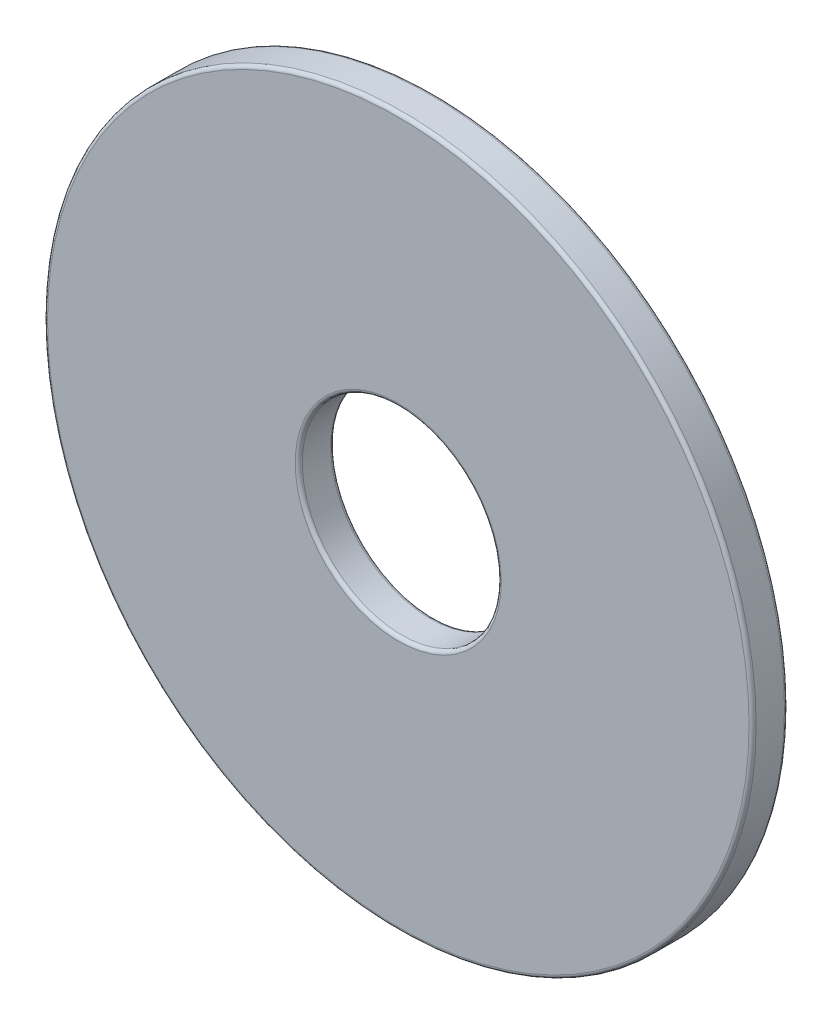
ISO-10303-21;
HEADER;
FILE_DESCRIPTION(('STEP AP214'),'2;1');
FILE_NAME('part.step','',(''),(''),'','','');
FILE_SCHEMA(('AUTOMOTIVE_DESIGN { 1 0 10303 214 1 1 1 1 }'));
ENDSEC;
DATA;
#1=APPLICATION_CONTEXT('core data for automotive mechanical design processes');
#2=APPLICATION_PROTOCOL_DEFINITION('international standard','automotive_design',2000,#1);
#3=PRODUCT_CONTEXT('',#1,'mechanical');
#4=PRODUCT('Part','Part','',(#3));
#5=PRODUCT_RELATED_PRODUCT_CATEGORY('part','',(#4));
#6=PRODUCT_DEFINITION_FORMATION('','',#4);
#7=PRODUCT_DEFINITION_CONTEXT('part definition',#1,'design');
#8=PRODUCT_DEFINITION('design','',#6,#7);
#9=PRODUCT_DEFINITION_SHAPE('','',#8);
#10=(LENGTH_UNIT() NAMED_UNIT(*) SI_UNIT(.MILLI.,.METRE.));
#11=(NAMED_UNIT(*) PLANE_ANGLE_UNIT() SI_UNIT($,.RADIAN.));
#12=(NAMED_UNIT(*) SI_UNIT($,.STERADIAN.) SOLID_ANGLE_UNIT());
#13=UNCERTAINTY_MEASURE_WITH_UNIT(LENGTH_MEASURE(1.E-05),#10,'distance_accuracy_value','');
#14=(GEOMETRIC_REPRESENTATION_CONTEXT(3) GLOBAL_UNCERTAINTY_ASSIGNED_CONTEXT((#13)) GLOBAL_UNIT_ASSIGNED_CONTEXT((#10,
#11,#12)) REPRESENTATION_CONTEXT('',''));
#15=CARTESIAN_POINT('',(0.,0.,0.));
#16=DIRECTION('',(0.,0.,1.));
#17=DIRECTION('',(1.,0.,0.));
#18=AXIS2_PLACEMENT_3D('',#15,#16,#17);
#19=CARTESIAN_POINT('',(0.,0.,-0.635000000000004));
#20=DIRECTION('',(0.,0.,1.));
#21=DIRECTION('',(1.,0.,0.));
#22=AXIS2_PLACEMENT_3D('',#19,#20,#21);
#23=CYLINDRICAL_SURFACE('',#22,12.7);
#24=CARTESIAN_POINT('',(0.,0.,0.508000000000006));
#25=DIRECTION('',(0.,0.,1.));
#26=DIRECTION('',(1.,0.,0.));
#27=AXIS2_PLACEMENT_3D('',#24,#25,#26);
#28=CIRCLE('',#27,12.7);
#29=CARTESIAN_POINT('',(12.7,0.,0.508000000000006));
#30=VERTEX_POINT('',#29);
#31=EDGE_CURVE('E10',#30,#30,#28,.F.);
#32=ORIENTED_EDGE('',*,*,#31,.T.);
#33=EDGE_LOOP('',(#32));
#34=FACE_BOUND('',#33,.T.);
#35=CARTESIAN_POINT('',(0.,0.,-0.508000000000004));
#36=DIRECTION('',(0.,0.,1.));
#37=DIRECTION('',(1.,0.,0.));
#38=AXIS2_PLACEMENT_3D('',#35,#36,#37);
#39=CIRCLE('',#38,12.7);
#40=CARTESIAN_POINT('',(12.7,0.,-0.508000000000004));
#41=VERTEX_POINT('',#40);
#42=EDGE_CURVE('E42',#41,#41,#39,.T.);
#43=ORIENTED_EDGE('',*,*,#42,.T.);
#44=EDGE_LOOP('',(#43));
#45=FACE_BOUND('',#44,.T.);
#46=ADVANCED_FACE('F35',(#34,#45),#23,.T.);
#47=CARTESIAN_POINT('',(0.,0.,-0.635000000000004));
#48=DIRECTION('',(0.,0.,1.));
#49=DIRECTION('',(1.,0.,0.));
#50=AXIS2_PLACEMENT_3D('',#47,#48,#49);
#51=PLANE('',#50);
#52=CARTESIAN_POINT('',(0.,0.,-0.635000000000004));
#53=DIRECTION('',(0.,0.,1.));
#54=DIRECTION('',(1.,0.,0.));
#55=AXIS2_PLACEMENT_3D('',#52,#53,#54);
#56=CIRCLE('',#55,3.6957);
#57=CARTESIAN_POINT('',(3.6957,0.,-0.635000000000004));
#58=VERTEX_POINT('',#57);
#59=EDGE_CURVE('E46',#58,#58,#56,.T.);
#60=ORIENTED_EDGE('',*,*,#59,.T.);
#61=EDGE_LOOP('',(#60));
#62=FACE_BOUND('',#61,.T.);
#63=CARTESIAN_POINT('',(0.,0.,-0.635000000000004));
#64=DIRECTION('',(0.,0.,1.));
#65=DIRECTION('',(1.,0.,0.));
#66=AXIS2_PLACEMENT_3D('',#63,#64,#65);
#67=CIRCLE('',#66,12.573);
#68=CARTESIAN_POINT('',(12.573,0.,-0.635000000000004));
#69=VERTEX_POINT('',#68);
#70=EDGE_CURVE('E50',#69,#69,#67,.F.);
#71=ORIENTED_EDGE('',*,*,#70,.T.);
#72=EDGE_LOOP('',(#71));
#73=FACE_BOUND('',#72,.T.);
#74=ADVANCED_FACE('F78',(#62,#73),#51,.F.);
#75=CARTESIAN_POINT('',(0.,0.,0.635000000000006));
#76=DIRECTION('',(0.,0.,1.));
#77=DIRECTION('',(1.,0.,0.));
#78=AXIS2_PLACEMENT_3D('',#75,#76,#77);
#79=PLANE('',#78);
#80=CARTESIAN_POINT('',(0.,0.,0.635000000000006));
#81=DIRECTION('',(0.,0.,1.));
#82=DIRECTION('',(1.,0.,0.));
#83=AXIS2_PLACEMENT_3D('',#80,#81,#82);
#84=CIRCLE('',#83,3.6957);
#85=CARTESIAN_POINT('',(3.6957,0.,0.635000000000006));
#86=VERTEX_POINT('',#85);
#87=EDGE_CURVE('E55',#86,#86,#84,.F.);
#88=ORIENTED_EDGE('',*,*,#87,.T.);
#89=EDGE_LOOP('',(#88));
#90=FACE_BOUND('',#89,.T.);
#91=CARTESIAN_POINT('',(0.,0.,0.635000000000006));
#92=DIRECTION('',(0.,0.,1.));
#93=DIRECTION('',(1.,0.,0.));
#94=AXIS2_PLACEMENT_3D('',#91,#92,#93);
#95=CIRCLE('',#94,12.573);
#96=CARTESIAN_POINT('',(12.573,0.,0.635000000000006));
#97=VERTEX_POINT('',#96);
#98=EDGE_CURVE('E58',#97,#97,#95,.T.);
#99=ORIENTED_EDGE('',*,*,#98,.T.);
#100=EDGE_LOOP('',(#99));
#101=FACE_BOUND('',#100,.T.);
#102=ADVANCED_FACE('F81',(#90,#101),#79,.T.);
#103=CARTESIAN_POINT('',(0.,0.,-0.635000000000004));
#104=DIRECTION('',(0.,0.,1.));
#105=DIRECTION('',(1.,0.,0.));
#106=AXIS2_PLACEMENT_3D('',#103,#104,#105);
#107=CYLINDRICAL_SURFACE('',#106,3.5687);
#108=CARTESIAN_POINT('',(0.,0.,0.508000000000006));
#109=DIRECTION('',(0.,0.,1.));
#110=DIRECTION('',(1.,0.,0.));
#111=AXIS2_PLACEMENT_3D('',#108,#109,#110);
#112=CIRCLE('',#111,3.5687);
#113=CARTESIAN_POINT('',(3.5687,0.,0.508000000000006));
#114=VERTEX_POINT('',#113);
#115=EDGE_CURVE('E61',#114,#114,#112,.T.);
#116=ORIENTED_EDGE('',*,*,#115,.T.);
#117=EDGE_LOOP('',(#116));
#118=FACE_BOUND('',#117,.T.);
#119=CARTESIAN_POINT('',(0.,0.,-0.508000000000004));
#120=DIRECTION('',(0.,0.,1.));
#121=DIRECTION('',(1.,0.,0.));
#122=AXIS2_PLACEMENT_3D('',#119,#120,#121);
#123=CIRCLE('',#122,3.5687);
#124=CARTESIAN_POINT('',(3.5687,0.,-0.508000000000004));
#125=VERTEX_POINT('',#124);
#126=EDGE_CURVE('E64',#125,#125,#123,.F.);
#127=ORIENTED_EDGE('',*,*,#126,.T.);
#128=EDGE_LOOP('',(#127));
#129=FACE_BOUND('',#128,.T.);
#130=ADVANCED_FACE('F68',(#118,#129),#107,.F.);
#131=CARTESIAN_POINT('',(0.,0.,0.508000000000006));
#132=DIRECTION('',(0.,0.,1.));
#133=DIRECTION('',(1.,0.,0.));
#134=AXIS2_PLACEMENT_3D('',#131,#132,#133);
#135=TOROIDAL_SURFACE('',#134,3.6957,0.127);
#136=ORIENTED_EDGE('',*,*,#87,.F.);
#137=EDGE_LOOP('',(#136));
#138=FACE_BOUND('',#137,.T.);
#139=ORIENTED_EDGE('',*,*,#115,.F.);
#140=EDGE_LOOP('',(#139));
#141=FACE_BOUND('',#140,.T.);
#142=ADVANCED_FACE('F74',(#138,#141),#135,.T.);
#143=CARTESIAN_POINT('',(0.,0.,-0.508000000000004));
#144=DIRECTION('',(0.,0.,1.));
#145=DIRECTION('',(1.,0.,0.));
#146=AXIS2_PLACEMENT_3D('',#143,#144,#145);
#147=TOROIDAL_SURFACE('',#146,3.6957,0.127);
#148=ORIENTED_EDGE('',*,*,#126,.F.);
#149=EDGE_LOOP('',(#148));
#150=FACE_BOUND('',#149,.T.);
#151=ORIENTED_EDGE('',*,*,#59,.F.);
#152=EDGE_LOOP('',(#151));
#153=FACE_BOUND('',#152,.T.);
#154=ADVANCED_FACE('F70',(#150,#153),#147,.T.);
#155=CARTESIAN_POINT('',(0.,0.,0.508000000000006));
#156=DIRECTION('',(0.,0.,1.));
#157=DIRECTION('',(1.,0.,0.));
#158=AXIS2_PLACEMENT_3D('',#155,#156,#157);
#159=TOROIDAL_SURFACE('',#158,12.573,0.127);
#160=ORIENTED_EDGE('',*,*,#31,.F.);
#161=EDGE_LOOP('',(#160));
#162=FACE_BOUND('',#161,.T.);
#163=ORIENTED_EDGE('',*,*,#98,.F.);
#164=EDGE_LOOP('',(#163));
#165=FACE_BOUND('',#164,.T.);
#166=ADVANCED_FACE('F73',(#162,#165),#159,.T.);
#167=CARTESIAN_POINT('',(0.,0.,-0.508000000000004));
#168=DIRECTION('',(0.,0.,1.));
#169=DIRECTION('',(1.,0.,0.));
#170=AXIS2_PLACEMENT_3D('',#167,#168,#169);
#171=TOROIDAL_SURFACE('',#170,12.573,0.127);
#172=ORIENTED_EDGE('',*,*,#70,.F.);
#173=EDGE_LOOP('',(#172));
#174=FACE_BOUND('',#173,.T.);
#175=ORIENTED_EDGE('',*,*,#42,.F.);
#176=EDGE_LOOP('',(#175));
#177=FACE_BOUND('',#176,.T.);
#178=ADVANCED_FACE('F37',(#174,#177),#171,.T.);
#179=CLOSED_SHELL('',(#46,#74,#102,#130,#142,#154,#166,#178));
#180=MANIFOLD_SOLID_BREP('B2',#179);
#181=ADVANCED_BREP_SHAPE_REPRESENTATION('',(#18,#180),#14);
#182=SHAPE_DEFINITION_REPRESENTATION(#9,#181);
ENDSEC;
END-ISO-10303-21;
